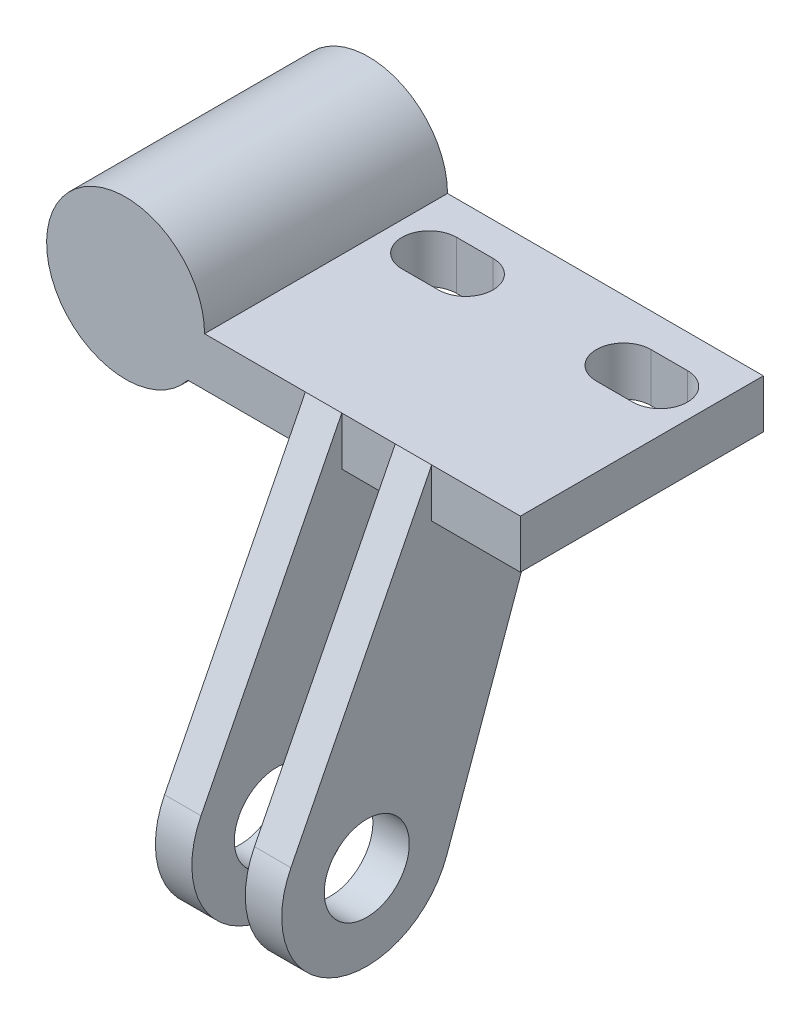
ISO-10303-21;
HEADER;
FILE_DESCRIPTION(('STEP AP214'),'2;1');
FILE_NAME('part.step','',(''),(''),'','','');
FILE_SCHEMA(('AUTOMOTIVE_DESIGN { 1 0 10303 214 1 1 1 1 }'));
ENDSEC;
DATA;
#1=APPLICATION_CONTEXT('core data for automotive mechanical design processes');
#2=APPLICATION_PROTOCOL_DEFINITION('international standard','automotive_design',2000,#1);
#3=PRODUCT_CONTEXT('',#1,'mechanical');
#4=PRODUCT('Part','Part','',(#3));
#5=PRODUCT_RELATED_PRODUCT_CATEGORY('part','',(#4));
#6=PRODUCT_DEFINITION_FORMATION('','',#4);
#7=PRODUCT_DEFINITION_CONTEXT('part definition',#1,'design');
#8=PRODUCT_DEFINITION('design','',#6,#7);
#9=PRODUCT_DEFINITION_SHAPE('','',#8);
#10=(LENGTH_UNIT() NAMED_UNIT(*) SI_UNIT(.MILLI.,.METRE.));
#11=(NAMED_UNIT(*) PLANE_ANGLE_UNIT() SI_UNIT($,.RADIAN.));
#12=(NAMED_UNIT(*) SI_UNIT($,.STERADIAN.) SOLID_ANGLE_UNIT());
#13=UNCERTAINTY_MEASURE_WITH_UNIT(LENGTH_MEASURE(1.E-05),#10,'distance_accuracy_value','');
#14=(GEOMETRIC_REPRESENTATION_CONTEXT(3) GLOBAL_UNCERTAINTY_ASSIGNED_CONTEXT((#13)) GLOBAL_UNIT_ASSIGNED_CONTEXT((#10,
#11,#12)) REPRESENTATION_CONTEXT('',''));
#15=CARTESIAN_POINT('',(0.,0.,0.));
#16=DIRECTION('',(0.,0.,1.));
#17=DIRECTION('',(1.,0.,0.));
#18=AXIS2_PLACEMENT_3D('',#15,#16,#17);
#19=CARTESIAN_POINT('',(5.1234753829798,-4.,20.));
#20=DIRECTION('',(0.,1.,0.));
#21=DIRECTION('',(0.,0.,1.));
#22=AXIS2_PLACEMENT_3D('',#19,#20,#21);
#23=PLANE('',#22);
#24=DIRECTION('',(-1.,0.,0.));
#25=VECTOR('',#24,1.);
#26=CARTESIAN_POINT('',(5.1234753829798,-4.,2.75));
#27=LINE('',#26,#25);
#28=CARTESIAN_POINT('',(13.,-4.,2.75));
#29=VERTEX_POINT('',#28);
#30=CARTESIAN_POINT('',(10.,-4.,2.75));
#31=VERTEX_POINT('',#30);
#32=EDGE_CURVE('E338',#29,#31,#27,.T.);
#33=ORIENTED_EDGE('',*,*,#32,.T.);
#34=CARTESIAN_POINT('',(10.,-4.,5.));
#35=DIRECTION('',(0.,1.,0.));
#36=DIRECTION('',(0.,0.,1.));
#37=AXIS2_PLACEMENT_3D('',#34,#35,#36);
#38=CIRCLE('',#37,2.25);
#39=CARTESIAN_POINT('',(10.,-4.,7.25));
#40=VERTEX_POINT('',#39);
#41=EDGE_CURVE('E341',#31,#40,#38,.T.);
#42=ORIENTED_EDGE('',*,*,#41,.T.);
#43=DIRECTION('',(1.,0.,0.));
#44=VECTOR('',#43,1.);
#45=CARTESIAN_POINT('',(5.1234753829798,-4.,7.25));
#46=LINE('',#45,#44);
#47=CARTESIAN_POINT('',(13.,-4.,7.25));
#48=VERTEX_POINT('',#47);
#49=EDGE_CURVE('E332',#40,#48,#46,.T.);
#50=ORIENTED_EDGE('',*,*,#49,.T.);
#51=CARTESIAN_POINT('',(13.,-4.,5.));
#52=DIRECTION('',(0.,1.,0.));
#53=DIRECTION('',(0.,0.,1.));
#54=AXIS2_PLACEMENT_3D('',#51,#52,#53);
#55=CIRCLE('',#54,2.25);
#56=EDGE_CURVE('E335',#48,#29,#55,.T.);
#57=ORIENTED_EDGE('',*,*,#56,.T.);
#58=EDGE_LOOP('',(#33,#42,#50,#57));
#59=FACE_BOUND('',#58,.T.);
#60=DIRECTION('',(-1.,0.,0.));
#61=VECTOR('',#60,1.);
#62=CARTESIAN_POINT('',(5.1234753829798,-4.,2.75));
#63=LINE('',#62,#61);
#64=CARTESIAN_POINT('',(29.,-4.,2.75));
#65=VERTEX_POINT('',#64);
#66=CARTESIAN_POINT('',(26.,-4.,2.75));
#67=VERTEX_POINT('',#66);
#68=EDGE_CURVE('E326',#65,#67,#63,.T.);
#69=ORIENTED_EDGE('',*,*,#68,.T.);
#70=CARTESIAN_POINT('',(26.,-4.,5.));
#71=DIRECTION('',(0.,1.,0.));
#72=DIRECTION('',(0.,0.,1.));
#73=AXIS2_PLACEMENT_3D('',#70,#71,#72);
#74=CIRCLE('',#73,2.25);
#75=CARTESIAN_POINT('',(26.,-4.,7.25));
#76=VERTEX_POINT('',#75);
#77=EDGE_CURVE('E329',#67,#76,#74,.T.);
#78=ORIENTED_EDGE('',*,*,#77,.T.);
#79=DIRECTION('',(1.,0.,0.));
#80=VECTOR('',#79,1.);
#81=CARTESIAN_POINT('',(5.1234753829798,-4.,7.25));
#82=LINE('',#81,#80);
#83=CARTESIAN_POINT('',(29.,-4.,7.25));
#84=VERTEX_POINT('',#83);
#85=EDGE_CURVE('E296',#76,#84,#82,.T.);
#86=ORIENTED_EDGE('',*,*,#85,.T.);
#87=CARTESIAN_POINT('',(29.,-4.,5.));
#88=DIRECTION('',(0.,1.,0.));
#89=DIRECTION('',(0.,0.,1.));
#90=AXIS2_PLACEMENT_3D('',#87,#88,#89);
#91=CIRCLE('',#90,2.25);
#92=EDGE_CURVE('E323',#84,#65,#91,.T.);
#93=ORIENTED_EDGE('',*,*,#92,.T.);
#94=EDGE_LOOP('',(#69,#78,#86,#93));
#95=FACE_BOUND('',#94,.T.);
#96=DIRECTION('',(0.,0.,-1.));
#97=VECTOR('',#96,1.);
#98=CARTESIAN_POINT('',(14.8,-4.,20.));
#99=LINE('',#98,#97);
#100=CARTESIAN_POINT('',(14.8,-4.,20.));
#101=VERTEX_POINT('',#100);
#102=CARTESIAN_POINT('',(14.8,-4.,10.0000000000152));
#103=VERTEX_POINT('',#102);
#104=EDGE_CURVE('E211',#101,#103,#99,.T.);
#105=ORIENTED_EDGE('',*,*,#104,.F.);
#106=DIRECTION('',(1.,0.,0.));
#107=VECTOR('',#106,1.);
#108=CARTESIAN_POINT('',(5.1234753829798,-4.,20.));
#109=LINE('',#108,#107);
#110=CARTESIAN_POINT('',(5.1234753829798,-4.,20.));
#111=VERTEX_POINT('',#110);
#112=EDGE_CURVE('E353',#111,#101,#109,.T.);
#113=ORIENTED_EDGE('',*,*,#112,.F.);
#114=DIRECTION('',(0.,0.,-1.));
#115=VECTOR('',#114,1.);
#116=CARTESIAN_POINT('',(5.1234753829798,-4.,20.));
#117=LINE('',#116,#115);
#118=CARTESIAN_POINT('',(5.1234753829798,-4.,0.));
#119=VERTEX_POINT('',#118);
#120=EDGE_CURVE('E11',#111,#119,#117,.T.);
#121=ORIENTED_EDGE('',*,*,#120,.T.);
#122=DIRECTION('',(1.,0.,0.));
#123=VECTOR('',#122,1.);
#124=CARTESIAN_POINT('',(5.1234753829798,-4.,0.));
#125=LINE('',#124,#123);
#126=CARTESIAN_POINT('',(32.5,-4.,0.));
#127=VERTEX_POINT('',#126);
#128=EDGE_CURVE('E367',#119,#127,#125,.T.);
#129=ORIENTED_EDGE('',*,*,#128,.T.);
#130=DIRECTION('',(0.,0.,-1.));
#131=VECTOR('',#130,1.);
#132=CARTESIAN_POINT('',(32.5,-4.,20.));
#133=LINE('',#132,#131);
#134=CARTESIAN_POINT('',(32.5,-4.,20.));
#135=VERTEX_POINT('',#134);
#136=EDGE_CURVE('E52',#135,#127,#133,.T.);
#137=ORIENTED_EDGE('',*,*,#136,.F.);
#138=CARTESIAN_POINT('',(25.2,-4.,20.));
#139=VERTEX_POINT('',#138);
#140=EDGE_CURVE('E351',#139,#135,#109,.T.);
#141=ORIENTED_EDGE('',*,*,#140,.F.);
#142=DIRECTION('',(0.,0.,1.));
#143=VECTOR('',#142,1.);
#144=CARTESIAN_POINT('',(25.2,-4.,20.));
#145=LINE('',#144,#143);
#146=CARTESIAN_POINT('',(25.2,-4.,10.0000000000152));
#147=VERTEX_POINT('',#146);
#148=EDGE_CURVE('E275',#147,#139,#145,.T.);
#149=ORIENTED_EDGE('',*,*,#148,.F.);
#150=DIRECTION('',(-1.,0.,0.));
#151=VECTOR('',#150,1.);
#152=CARTESIAN_POINT('',(25.2,-3.99999999995766,10.));
#153=LINE('',#152,#151);
#154=CARTESIAN_POINT('',(22.2,-4.,10.0000000000152));
#155=VERTEX_POINT('',#154);
#156=EDGE_CURVE('E253',#147,#155,#153,.T.);
#157=ORIENTED_EDGE('',*,*,#156,.T.);
#158=DIRECTION('',(0.,0.,1.));
#159=VECTOR('',#158,1.);
#160=CARTESIAN_POINT('',(22.2,-4.,20.));
#161=LINE('',#160,#159);
#162=CARTESIAN_POINT('',(22.2,-4.,20.));
#163=VERTEX_POINT('',#162);
#164=EDGE_CURVE('E269',#155,#163,#161,.T.);
#165=ORIENTED_EDGE('',*,*,#164,.T.);
#166=CARTESIAN_POINT('',(17.8,-4.,20.));
#167=VERTEX_POINT('',#166);
#168=EDGE_CURVE('E357',#167,#163,#109,.T.);
#169=ORIENTED_EDGE('',*,*,#168,.F.);
#170=DIRECTION('',(0.,0.,-1.));
#171=VECTOR('',#170,1.);
#172=CARTESIAN_POINT('',(17.8,-4.,20.));
#173=LINE('',#172,#171);
#174=CARTESIAN_POINT('',(17.8,-4.,10.));
#175=VERTEX_POINT('',#174);
#176=EDGE_CURVE('E64',#167,#175,#173,.T.);
#177=ORIENTED_EDGE('',*,*,#176,.T.);
#178=DIRECTION('',(1.,0.,0.));
#179=VECTOR('',#178,1.);
#180=CARTESIAN_POINT('',(14.8,-3.99999999995766,10.));
#181=LINE('',#180,#179);
#182=EDGE_CURVE('E59',#103,#175,#181,.T.);
#183=ORIENTED_EDGE('',*,*,#182,.F.);
#184=EDGE_LOOP('',(#105,#113,#121,#129,#137,#141,#149,#157,#165,#169,#177,#183));
#185=FACE_BOUND('',#184,.T.);
#186=ADVANCED_FACE('F43',(#59,#95,#185),#23,.F.);
#187=CARTESIAN_POINT('',(0.,0.,20.));
#188=DIRECTION('',(0.,0.,1.));
#189=DIRECTION('',(1.,0.,0.));
#190=AXIS2_PLACEMENT_3D('',#187,#188,#189);
#191=PLANE('',#190);
#192=ORIENTED_EDGE('',*,*,#112,.T.);
#193=DIRECTION('',(0.,1.,0.));
#194=VECTOR('',#193,1.);
#195=CARTESIAN_POINT('',(14.8,0.,20.));
#196=LINE('',#195,#194);
#197=CARTESIAN_POINT('',(14.8,0.,20.));
#198=VERTEX_POINT('',#197);
#199=EDGE_CURVE('E234',#101,#198,#196,.T.);
#200=ORIENTED_EDGE('',*,*,#199,.T.);
#201=DIRECTION('',(-1.,0.,0.));
#202=VECTOR('',#201,1.);
#203=CARTESIAN_POINT('',(32.5,0.,20.));
#204=LINE('',#203,#202);
#205=CARTESIAN_POINT('',(6.5,0.,20.));
#206=VERTEX_POINT('',#205);
#207=EDGE_CURVE('E359',#198,#206,#204,.T.);
#208=ORIENTED_EDGE('',*,*,#207,.T.);
#209=CARTESIAN_POINT('',(0.,0.,20.));
#210=DIRECTION('',(0.,0.,1.));
#211=DIRECTION('',(1.,0.,0.));
#212=AXIS2_PLACEMENT_3D('',#209,#210,#211);
#213=CIRCLE('',#212,6.5);
#214=EDGE_CURVE('E348',#206,#111,#213,.T.);
#215=ORIENTED_EDGE('',*,*,#214,.T.);
#216=EDGE_LOOP('',(#192,#200,#208,#215));
#217=FACE_BOUND('',#216,.T.);
#218=ADVANCED_FACE('F398',(#217),#191,.T.);
#219=CARTESIAN_POINT('',(32.5,0.,20.));
#220=VERTEX_POINT('',#219);
#221=CARTESIAN_POINT('',(25.2,0.,20.));
#222=VERTEX_POINT('',#221);
#223=EDGE_CURVE('E360',#220,#222,#204,.T.);
#224=ORIENTED_EDGE('',*,*,#223,.T.);
#225=DIRECTION('',(0.,-1.,0.));
#226=VECTOR('',#225,1.);
#227=CARTESIAN_POINT('',(25.2,0.,20.));
#228=LINE('',#227,#226);
#229=EDGE_CURVE('E278',#222,#139,#228,.T.);
#230=ORIENTED_EDGE('',*,*,#229,.T.);
#231=ORIENTED_EDGE('',*,*,#140,.T.);
#232=DIRECTION('',(0.,1.,0.));
#233=VECTOR('',#232,1.);
#234=CARTESIAN_POINT('',(32.5,-4.,20.));
#235=LINE('',#234,#233);
#236=EDGE_CURVE('E356',#135,#220,#235,.T.);
#237=ORIENTED_EDGE('',*,*,#236,.T.);
#238=EDGE_LOOP('',(#224,#230,#231,#237));
#239=FACE_BOUND('',#238,.T.);
#240=ADVANCED_FACE('F427',(#239),#191,.T.);
#241=CARTESIAN_POINT('',(0.,0.,20.));
#242=DIRECTION('',(0.,0.,-1.));
#243=DIRECTION('',(-1.,0.,0.));
#244=AXIS2_PLACEMENT_3D('',#241,#242,#243);
#245=CYLINDRICAL_SURFACE('',#244,4.1);
#246=CARTESIAN_POINT('',(0.,0.,0.));
#247=DIRECTION('',(0.,0.,1.));
#248=DIRECTION('',(1.,0.,0.));
#249=AXIS2_PLACEMENT_3D('',#246,#247,#248);
#250=CIRCLE('',#249,4.1);
#251=CARTESIAN_POINT('',(4.1,0.,0.));
#252=VERTEX_POINT('',#251);
#253=EDGE_CURVE('E344',#252,#252,#250,.T.);
#254=ORIENTED_EDGE('',*,*,#253,.F.);
#255=EDGE_LOOP('',(#254));
#256=FACE_BOUND('',#255,.T.);
#257=CARTESIAN_POINT('',(0.,0.,17.));
#258=DIRECTION('',(0.,0.,1.));
#259=DIRECTION('',(1.,0.,0.));
#260=AXIS2_PLACEMENT_3D('',#257,#258,#259);
#261=CIRCLE('',#260,4.1);
#262=CARTESIAN_POINT('',(4.1,0.,17.));
#263=VERTEX_POINT('',#262);
#264=EDGE_CURVE('E47',#263,#263,#261,.T.);
#265=ORIENTED_EDGE('',*,*,#264,.T.);
#266=EDGE_LOOP('',(#265));
#267=FACE_BOUND('',#266,.T.);
#268=ADVANCED_FACE('F440',(#256,#267),#245,.F.);
#269=DIRECTION('',(0.,1.,0.));
#270=VECTOR('',#269,1.);
#271=CARTESIAN_POINT('',(17.8,0.,20.));
#272=LINE('',#271,#270);
#273=CARTESIAN_POINT('',(17.8,0.,20.));
#274=VERTEX_POINT('',#273);
#275=EDGE_CURVE('E230',#167,#274,#272,.T.);
#276=ORIENTED_EDGE('',*,*,#275,.F.);
#277=ORIENTED_EDGE('',*,*,#168,.T.);
#278=DIRECTION('',(0.,-1.,0.));
#279=VECTOR('',#278,1.);
#280=CARTESIAN_POINT('',(22.2,0.,20.));
#281=LINE('',#280,#279);
#282=CARTESIAN_POINT('',(22.2,0.,20.));
#283=VERTEX_POINT('',#282);
#284=EDGE_CURVE('E272',#283,#163,#281,.T.);
#285=ORIENTED_EDGE('',*,*,#284,.F.);
#286=EDGE_CURVE('E364',#283,#274,#204,.T.);
#287=ORIENTED_EDGE('',*,*,#286,.T.);
#288=EDGE_LOOP('',(#276,#277,#285,#287));
#289=FACE_BOUND('',#288,.T.);
#290=ADVANCED_FACE('F403',(#289),#191,.T.);
#291=CARTESIAN_POINT('',(0.,0.,0.));
#292=DIRECTION('',(0.,0.,1.));
#293=DIRECTION('',(1.,0.,0.));
#294=AXIS2_PLACEMENT_3D('',#291,#292,#293);
#295=PLANE('',#294);
#296=CARTESIAN_POINT('',(0.,0.,0.));
#297=DIRECTION('',(0.,0.,1.));
#298=DIRECTION('',(1.,0.,0.));
#299=AXIS2_PLACEMENT_3D('',#296,#297,#298);
#300=CIRCLE('',#299,6.5);
#301=CARTESIAN_POINT('',(6.5,0.,0.));
#302=VERTEX_POINT('',#301);
#303=EDGE_CURVE('E347',#302,#119,#300,.T.);
#304=ORIENTED_EDGE('',*,*,#303,.F.);
#305=DIRECTION('',(-1.,0.,0.));
#306=VECTOR('',#305,1.);
#307=CARTESIAN_POINT('',(32.5,0.,0.));
#308=LINE('',#307,#306);
#309=CARTESIAN_POINT('',(32.5,0.,0.));
#310=VERTEX_POINT('',#309);
#311=EDGE_CURVE('E352',#310,#302,#308,.T.);
#312=ORIENTED_EDGE('',*,*,#311,.F.);
#313=DIRECTION('',(0.,1.,0.));
#314=VECTOR('',#313,1.);
#315=CARTESIAN_POINT('',(32.5,-4.,0.));
#316=LINE('',#315,#314);
#317=EDGE_CURVE('E369',#127,#310,#316,.T.);
#318=ORIENTED_EDGE('',*,*,#317,.F.);
#319=ORIENTED_EDGE('',*,*,#128,.F.);
#320=EDGE_LOOP('',(#304,#312,#318,#319));
#321=FACE_BOUND('',#320,.T.);
#322=ORIENTED_EDGE('',*,*,#253,.T.);
#323=EDGE_LOOP('',(#322));
#324=FACE_BOUND('',#323,.T.);
#325=ADVANCED_FACE('F388',(#321,#324),#295,.F.);
#326=CARTESIAN_POINT('',(0.,0.,20.));
#327=DIRECTION('',(0.,0.,-1.));
#328=DIRECTION('',(-1.,0.,0.));
#329=AXIS2_PLACEMENT_3D('',#326,#327,#328);
#330=CYLINDRICAL_SURFACE('',#329,6.5);
#331=ORIENTED_EDGE('',*,*,#303,.T.);
#332=ORIENTED_EDGE('',*,*,#120,.F.);
#333=ORIENTED_EDGE('',*,*,#214,.F.);
#334=DIRECTION('',(0.,0.,-1.));
#335=VECTOR('',#334,1.);
#336=CARTESIAN_POINT('',(6.5,0.,20.));
#337=LINE('',#336,#335);
#338=EDGE_CURVE('E363',#206,#302,#337,.T.);
#339=ORIENTED_EDGE('',*,*,#338,.T.);
#340=EDGE_LOOP('',(#331,#332,#333,#339));
#341=FACE_BOUND('',#340,.T.);
#342=ADVANCED_FACE('F45',(#341),#330,.T.);
#343=CARTESIAN_POINT('',(32.5,-4.,20.));
#344=DIRECTION('',(-1.,0.,0.));
#345=DIRECTION('',(0.,0.,1.));
#346=AXIS2_PLACEMENT_3D('',#343,#344,#345);
#347=PLANE('',#346);
#348=ORIENTED_EDGE('',*,*,#317,.T.);
#349=DIRECTION('',(0.,0.,-1.));
#350=VECTOR('',#349,1.);
#351=CARTESIAN_POINT('',(32.5,0.,20.));
#352=LINE('',#351,#350);
#353=EDGE_CURVE('E374',#220,#310,#352,.T.);
#354=ORIENTED_EDGE('',*,*,#353,.F.);
#355=ORIENTED_EDGE('',*,*,#236,.F.);
#356=ORIENTED_EDGE('',*,*,#136,.T.);
#357=EDGE_LOOP('',(#348,#354,#355,#356));
#358=FACE_BOUND('',#357,.T.);
#359=ADVANCED_FACE('F382',(#358),#347,.F.);
#360=CARTESIAN_POINT('',(32.5,0.,20.));
#361=DIRECTION('',(0.,-1.,0.));
#362=DIRECTION('',(1.,0.,0.));
#363=AXIS2_PLACEMENT_3D('',#360,#361,#362);
#364=PLANE('',#363);
#365=DIRECTION('',(1.,0.,0.));
#366=VECTOR('',#365,1.);
#367=CARTESIAN_POINT('',(10.,0.,7.25));
#368=LINE('',#367,#366);
#369=CARTESIAN_POINT('',(10.,0.,7.25));
#370=VERTEX_POINT('',#369);
#371=CARTESIAN_POINT('',(13.,0.,7.25));
#372=VERTEX_POINT('',#371);
#373=EDGE_CURVE('E283',#370,#372,#368,.T.);
#374=ORIENTED_EDGE('',*,*,#373,.F.);
#375=CARTESIAN_POINT('',(10.,0.,5.));
#376=DIRECTION('',(0.,1.,0.));
#377=DIRECTION('',(-1.,0.,0.));
#378=AXIS2_PLACEMENT_3D('',#375,#376,#377);
#379=CIRCLE('',#378,2.25);
#380=CARTESIAN_POINT('',(10.,0.,2.75));
#381=VERTEX_POINT('',#380);
#382=EDGE_CURVE('E281',#381,#370,#379,.T.);
#383=ORIENTED_EDGE('',*,*,#382,.F.);
#384=DIRECTION('',(-1.,0.,0.));
#385=VECTOR('',#384,1.);
#386=CARTESIAN_POINT('',(10.,0.,2.75));
#387=LINE('',#386,#385);
#388=CARTESIAN_POINT('',(13.,0.,2.75));
#389=VERTEX_POINT('',#388);
#390=EDGE_CURVE('E290',#389,#381,#387,.T.);
#391=ORIENTED_EDGE('',*,*,#390,.F.);
#392=CARTESIAN_POINT('',(13.,0.,5.));
#393=DIRECTION('',(0.,1.,0.));
#394=DIRECTION('',(-1.,0.,0.));
#395=AXIS2_PLACEMENT_3D('',#392,#393,#394);
#396=CIRCLE('',#395,2.25);
#397=EDGE_CURVE('E287',#372,#389,#396,.T.);
#398=ORIENTED_EDGE('',*,*,#397,.F.);
#399=EDGE_LOOP('',(#374,#383,#391,#398));
#400=FACE_BOUND('',#399,.T.);
#401=DIRECTION('',(1.,0.,0.));
#402=VECTOR('',#401,1.);
#403=CARTESIAN_POINT('',(26.,0.,7.25));
#404=LINE('',#403,#402);
#405=CARTESIAN_POINT('',(26.,0.,7.25));
#406=VERTEX_POINT('',#405);
#407=CARTESIAN_POINT('',(29.,0.,7.25));
#408=VERTEX_POINT('',#407);
#409=EDGE_CURVE('E317',#406,#408,#404,.T.);
#410=ORIENTED_EDGE('',*,*,#409,.F.);
#411=CARTESIAN_POINT('',(26.,0.,5.));
#412=DIRECTION('',(0.,1.,0.));
#413=DIRECTION('',(-1.,0.,0.));
#414=AXIS2_PLACEMENT_3D('',#411,#412,#413);
#415=CIRCLE('',#414,2.25);
#416=CARTESIAN_POINT('',(26.,0.,2.75));
#417=VERTEX_POINT('',#416);
#418=EDGE_CURVE('E284',#417,#406,#415,.T.);
#419=ORIENTED_EDGE('',*,*,#418,.F.);
#420=DIRECTION('',(-1.,0.,0.));
#421=VECTOR('',#420,1.);
#422=CARTESIAN_POINT('',(26.,0.,2.75));
#423=LINE('',#422,#421);
#424=CARTESIAN_POINT('',(29.,0.,2.75));
#425=VERTEX_POINT('',#424);
#426=EDGE_CURVE('E306',#425,#417,#423,.T.);
#427=ORIENTED_EDGE('',*,*,#426,.F.);
#428=CARTESIAN_POINT('',(29.,0.,5.));
#429=DIRECTION('',(0.,1.,0.));
#430=DIRECTION('',(-1.,0.,0.));
#431=AXIS2_PLACEMENT_3D('',#428,#429,#430);
#432=CIRCLE('',#431,2.25);
#433=EDGE_CURVE('E314',#408,#425,#432,.T.);
#434=ORIENTED_EDGE('',*,*,#433,.F.);
#435=EDGE_LOOP('',(#410,#419,#427,#434));
#436=FACE_BOUND('',#435,.T.);
#437=ORIENTED_EDGE('',*,*,#311,.T.);
#438=ORIENTED_EDGE('',*,*,#338,.F.);
#439=ORIENTED_EDGE('',*,*,#207,.F.);
#440=DIRECTION('',(1.,0.,0.));
#441=VECTOR('',#440,1.);
#442=CARTESIAN_POINT('',(14.8,0.,20.));
#443=LINE('',#442,#441);
#444=EDGE_CURVE('E217',#198,#274,#443,.T.);
#445=ORIENTED_EDGE('',*,*,#444,.T.);
#446=ORIENTED_EDGE('',*,*,#286,.F.);
#447=DIRECTION('',(-1.,0.,0.));
#448=VECTOR('',#447,1.);
#449=CARTESIAN_POINT('',(25.2,0.,20.));
#450=LINE('',#449,#448);
#451=EDGE_CURVE('E266',#222,#283,#450,.T.);
#452=ORIENTED_EDGE('',*,*,#451,.F.);
#453=ORIENTED_EDGE('',*,*,#223,.F.);
#454=ORIENTED_EDGE('',*,*,#353,.T.);
#455=EDGE_LOOP('',(#437,#438,#439,#445,#446,#452,#453,#454));
#456=FACE_BOUND('',#455,.T.);
#457=ADVANCED_FACE('F392',(#400,#436,#456),#364,.F.);
#458=CARTESIAN_POINT('',(0.,0.,17.));
#459=DIRECTION('',(0.,0.,1.));
#460=DIRECTION('',(1.,0.,0.));
#461=AXIS2_PLACEMENT_3D('',#458,#459,#460);
#462=PLANE('',#461);
#463=ORIENTED_EDGE('',*,*,#264,.F.);
#464=EDGE_LOOP('',(#463));
#465=FACE_BOUND('',#464,.T.);
#466=ADVANCED_FACE('F435',(#465),#462,.F.);
#467=CARTESIAN_POINT('',(26.,-13.,5.));
#468=DIRECTION('',(0.,1.,0.));
#469=DIRECTION('',(-1.,0.,0.));
#470=AXIS2_PLACEMENT_3D('',#467,#468,#469);
#471=CYLINDRICAL_SURFACE('',#470,2.25);
#472=DIRECTION('',(0.,1.,0.));
#473=VECTOR('',#472,1.);
#474=CARTESIAN_POINT('',(26.,-13.,2.75));
#475=LINE('',#474,#473);
#476=EDGE_CURVE('E280',#67,#417,#475,.T.);
#477=ORIENTED_EDGE('',*,*,#476,.T.);
#478=ORIENTED_EDGE('',*,*,#418,.T.);
#479=DIRECTION('',(0.,1.,0.));
#480=VECTOR('',#479,1.);
#481=CARTESIAN_POINT('',(26.,-13.,7.25));
#482=LINE('',#481,#480);
#483=EDGE_CURVE('E303',#76,#406,#482,.T.);
#484=ORIENTED_EDGE('',*,*,#483,.F.);
#485=ORIENTED_EDGE('',*,*,#77,.F.);
#486=EDGE_LOOP('',(#477,#478,#484,#485));
#487=FACE_BOUND('',#486,.T.);
#488=ADVANCED_FACE('F446',(#487),#471,.F.);
#489=CARTESIAN_POINT('',(26.,-13.,2.75));
#490=DIRECTION('',(0.,0.,-1.));
#491=DIRECTION('',(-1.,0.,0.));
#492=AXIS2_PLACEMENT_3D('',#489,#490,#491);
#493=PLANE('',#492);
#494=DIRECTION('',(0.,1.,0.));
#495=VECTOR('',#494,1.);
#496=CARTESIAN_POINT('',(29.,-13.,2.75));
#497=LINE('',#496,#495);
#498=EDGE_CURVE('E309',#65,#425,#497,.T.);
#499=ORIENTED_EDGE('',*,*,#498,.T.);
#500=ORIENTED_EDGE('',*,*,#426,.T.);
#501=ORIENTED_EDGE('',*,*,#476,.F.);
#502=ORIENTED_EDGE('',*,*,#68,.F.);
#503=EDGE_LOOP('',(#499,#500,#501,#502));
#504=FACE_BOUND('',#503,.T.);
#505=ADVANCED_FACE('F448',(#504),#493,.F.);
#506=CARTESIAN_POINT('',(29.,-13.,5.));
#507=DIRECTION('',(0.,1.,0.));
#508=DIRECTION('',(-1.,0.,0.));
#509=AXIS2_PLACEMENT_3D('',#506,#507,#508);
#510=CYLINDRICAL_SURFACE('',#509,2.25);
#511=DIRECTION('',(0.,1.,0.));
#512=VECTOR('',#511,1.);
#513=CARTESIAN_POINT('',(29.,-13.,7.25));
#514=LINE('',#513,#512);
#515=EDGE_CURVE('E307',#84,#408,#514,.T.);
#516=ORIENTED_EDGE('',*,*,#515,.T.);
#517=ORIENTED_EDGE('',*,*,#433,.T.);
#518=ORIENTED_EDGE('',*,*,#498,.F.);
#519=ORIENTED_EDGE('',*,*,#92,.F.);
#520=EDGE_LOOP('',(#516,#517,#518,#519));
#521=FACE_BOUND('',#520,.T.);
#522=ADVANCED_FACE('F451',(#521),#510,.F.);
#523=CARTESIAN_POINT('',(26.,-13.,7.25));
#524=DIRECTION('',(0.,0.,1.));
#525=DIRECTION('',(1.,0.,0.));
#526=AXIS2_PLACEMENT_3D('',#523,#524,#525);
#527=PLANE('',#526);
#528=ORIENTED_EDGE('',*,*,#483,.T.);
#529=ORIENTED_EDGE('',*,*,#409,.T.);
#530=ORIENTED_EDGE('',*,*,#515,.F.);
#531=ORIENTED_EDGE('',*,*,#85,.F.);
#532=EDGE_LOOP('',(#528,#529,#530,#531));
#533=FACE_BOUND('',#532,.T.);
#534=ADVANCED_FACE('F455',(#533),#527,.F.);
#535=CARTESIAN_POINT('',(10.,-13.,5.));
#536=DIRECTION('',(0.,1.,0.));
#537=DIRECTION('',(-1.,0.,0.));
#538=AXIS2_PLACEMENT_3D('',#535,#536,#537);
#539=CYLINDRICAL_SURFACE('',#538,2.25);
#540=DIRECTION('',(0.,1.,0.));
#541=VECTOR('',#540,1.);
#542=CARTESIAN_POINT('',(10.,-13.,2.75));
#543=LINE('',#542,#541);
#544=EDGE_CURVE('E294',#31,#381,#543,.T.);
#545=ORIENTED_EDGE('',*,*,#544,.T.);
#546=ORIENTED_EDGE('',*,*,#382,.T.);
#547=DIRECTION('',(0.,1.,0.));
#548=VECTOR('',#547,1.);
#549=CARTESIAN_POINT('',(10.,-13.,7.25));
#550=LINE('',#549,#548);
#551=EDGE_CURVE('E293',#40,#370,#550,.T.);
#552=ORIENTED_EDGE('',*,*,#551,.F.);
#553=ORIENTED_EDGE('',*,*,#41,.F.);
#554=EDGE_LOOP('',(#545,#546,#552,#553));
#555=FACE_BOUND('',#554,.T.);
#556=ADVANCED_FACE('F459',(#555),#539,.F.);
#557=CARTESIAN_POINT('',(10.,-13.,2.75));
#558=DIRECTION('',(0.,0.,-1.));
#559=DIRECTION('',(-1.,0.,0.));
#560=AXIS2_PLACEMENT_3D('',#557,#558,#559);
#561=PLANE('',#560);
#562=DIRECTION('',(0.,1.,0.));
#563=VECTOR('',#562,1.);
#564=CARTESIAN_POINT('',(13.,-13.,2.75));
#565=LINE('',#564,#563);
#566=EDGE_CURVE('E297',#29,#389,#565,.T.);
#567=ORIENTED_EDGE('',*,*,#566,.T.);
#568=ORIENTED_EDGE('',*,*,#390,.T.);
#569=ORIENTED_EDGE('',*,*,#544,.F.);
#570=ORIENTED_EDGE('',*,*,#32,.F.);
#571=EDGE_LOOP('',(#567,#568,#569,#570));
#572=FACE_BOUND('',#571,.T.);
#573=ADVANCED_FACE('F466',(#572),#561,.F.);
#574=CARTESIAN_POINT('',(13.,-13.,5.));
#575=DIRECTION('',(0.,1.,0.));
#576=DIRECTION('',(-1.,0.,0.));
#577=AXIS2_PLACEMENT_3D('',#574,#575,#576);
#578=CYLINDRICAL_SURFACE('',#577,2.25);
#579=DIRECTION('',(0.,1.,0.));
#580=VECTOR('',#579,1.);
#581=CARTESIAN_POINT('',(13.,-13.,7.25));
#582=LINE('',#581,#580);
#583=EDGE_CURVE('E299',#48,#372,#582,.T.);
#584=ORIENTED_EDGE('',*,*,#583,.T.);
#585=ORIENTED_EDGE('',*,*,#397,.T.);
#586=ORIENTED_EDGE('',*,*,#566,.F.);
#587=ORIENTED_EDGE('',*,*,#56,.F.);
#588=EDGE_LOOP('',(#584,#585,#586,#587));
#589=FACE_BOUND('',#588,.T.);
#590=ADVANCED_FACE('F472',(#589),#578,.F.);
#591=CARTESIAN_POINT('',(10.,-13.,7.25));
#592=DIRECTION('',(0.,0.,1.));
#593=DIRECTION('',(1.,0.,0.));
#594=AXIS2_PLACEMENT_3D('',#591,#592,#593);
#595=PLANE('',#594);
#596=ORIENTED_EDGE('',*,*,#551,.T.);
#597=ORIENTED_EDGE('',*,*,#373,.T.);
#598=ORIENTED_EDGE('',*,*,#583,.F.);
#599=ORIENTED_EDGE('',*,*,#49,.F.);
#600=EDGE_LOOP('',(#596,#597,#598,#599));
#601=FACE_BOUND('',#600,.T.);
#602=ADVANCED_FACE('F468',(#601),#595,.F.);
#603=CARTESIAN_POINT('',(25.2,-26.0779866927372,25.3455707796658));
#604=DIRECTION('',(-1.,0.,0.));
#605=DIRECTION('',(0.,0.,1.));
#606=AXIS2_PLACEMENT_3D('',#603,#604,#605);
#607=PLANE('',#606);
#608=ORIENTED_EDGE('',*,*,#229,.F.);
#609=DIRECTION('',(0.,-0.892350435757835,0.451343217300097));
#610=VECTOR('',#609,1.);
#611=CARTESIAN_POINT('',(25.2,-22.9185841716366,31.5920238299707));
#612=LINE('',#611,#610);
#613=CARTESIAN_POINT('',(25.2,-22.9185841716366,31.5920238299707));
#614=VERTEX_POINT('',#613);
#615=EDGE_CURVE('E245',#222,#614,#612,.T.);
#616=ORIENTED_EDGE('',*,*,#615,.T.);
#617=CARTESIAN_POINT('',(25.2,-26.0779866927372,25.3455707796658));
#618=DIRECTION('',(1.,0.,0.));
#619=DIRECTION('',(0.,0.,1.));
#620=AXIS2_PLACEMENT_3D('',#617,#618,#619);
#621=CIRCLE('',#620,7.);
#622=CARTESIAN_POINT('',(25.2,-28.4389274391951,18.7557332405671));
#623=VERTEX_POINT('',#622);
#624=EDGE_CURVE('E247',#614,#623,#621,.T.);
#625=ORIENTED_EDGE('',*,*,#624,.T.);
#626=DIRECTION('',(0.,0.941405362728391,-0.337277249493984));
#627=VECTOR('',#626,1.);
#628=CARTESIAN_POINT('',(25.2,-3.99999999995766,10.));
#629=LINE('',#628,#627);
#630=EDGE_CURVE('E250',#623,#147,#629,.T.);
#631=ORIENTED_EDGE('',*,*,#630,.T.);
#632=ORIENTED_EDGE('',*,*,#148,.T.);
#633=EDGE_LOOP('',(#608,#616,#625,#631,#632));
#634=FACE_BOUND('',#633,.T.);
#635=CARTESIAN_POINT('',(25.2,-26.0779866927372,25.3455707796658));
#636=DIRECTION('',(1.,0.,0.));
#637=DIRECTION('',(0.,0.,1.));
#638=AXIS2_PLACEMENT_3D('',#635,#636,#637);
#639=CIRCLE('',#638,3.4999999999984);
#640=CARTESIAN_POINT('',(25.2,-26.0779866927372,28.8455707796642));
#641=VERTEX_POINT('',#640);
#642=EDGE_CURVE('E239',#641,#641,#639,.T.);
#643=ORIENTED_EDGE('',*,*,#642,.F.);
#644=EDGE_LOOP('',(#643));
#645=FACE_BOUND('',#644,.T.);
#646=ADVANCED_FACE('F471',(#634,#645),#607,.F.);
#647=CARTESIAN_POINT('',(22.2,-26.0779866927372,25.3455707796658));
#648=DIRECTION('',(-1.,0.,0.));
#649=DIRECTION('',(0.,0.,1.));
#650=AXIS2_PLACEMENT_3D('',#647,#648,#649);
#651=PLANE('',#650);
#652=DIRECTION('',(0.,-0.892350435757835,0.451343217300097));
#653=VECTOR('',#652,1.);
#654=CARTESIAN_POINT('',(22.2,-22.9185841716366,31.5920238299707));
#655=LINE('',#654,#653);
#656=CARTESIAN_POINT('',(22.2,-22.9185841716366,31.5920238299707));
#657=VERTEX_POINT('',#656);
#658=EDGE_CURVE('E242',#283,#657,#655,.T.);
#659=ORIENTED_EDGE('',*,*,#658,.F.);
#660=ORIENTED_EDGE('',*,*,#284,.T.);
#661=ORIENTED_EDGE('',*,*,#164,.F.);
#662=DIRECTION('',(0.,0.941405362728391,-0.337277249493984));
#663=VECTOR('',#662,1.);
#664=CARTESIAN_POINT('',(22.2,-3.99999999995766,10.));
#665=LINE('',#664,#663);
#666=CARTESIAN_POINT('',(22.2,-28.4389274391951,18.7557332405671));
#667=VERTEX_POINT('',#666);
#668=EDGE_CURVE('E248',#667,#155,#665,.T.);
#669=ORIENTED_EDGE('',*,*,#668,.F.);
#670=CARTESIAN_POINT('',(22.2,-26.0779866927372,25.3455707796658));
#671=DIRECTION('',(1.,0.,0.));
#672=DIRECTION('',(0.,0.,1.));
#673=AXIS2_PLACEMENT_3D('',#670,#671,#672);
#674=CIRCLE('',#673,7.);
#675=EDGE_CURVE('E255',#657,#667,#674,.T.);
#676=ORIENTED_EDGE('',*,*,#675,.F.);
#677=EDGE_LOOP('',(#659,#660,#661,#669,#676));
#678=FACE_BOUND('',#677,.T.);
#679=CARTESIAN_POINT('',(22.2,-26.0779866927372,25.3455707796658));
#680=DIRECTION('',(1.,0.,0.));
#681=DIRECTION('',(0.,0.,1.));
#682=AXIS2_PLACEMENT_3D('',#679,#680,#681);
#683=CIRCLE('',#682,3.4999999999984);
#684=CARTESIAN_POINT('',(22.2,-26.0779866927372,28.8455707796642));
#685=VERTEX_POINT('',#684);
#686=EDGE_CURVE('E238',#685,#685,#683,.T.);
#687=ORIENTED_EDGE('',*,*,#686,.T.);
#688=EDGE_LOOP('',(#687));
#689=FACE_BOUND('',#688,.T.);
#690=ADVANCED_FACE('F484',(#678,#689),#651,.T.);
#691=CARTESIAN_POINT('',(25.2,-22.9185841716366,31.5920238299707));
#692=DIRECTION('',(0.,-0.451343217300097,-0.892350435757835));
#693=DIRECTION('',(0.,0.892350435757835,-0.451343217300097));
#694=AXIS2_PLACEMENT_3D('',#691,#692,#693);
#695=PLANE('',#694);
#696=ORIENTED_EDGE('',*,*,#658,.T.);
#697=DIRECTION('',(-1.,0.,0.));
#698=VECTOR('',#697,1.);
#699=CARTESIAN_POINT('',(25.2,-22.9185841716366,31.5920238299707));
#700=LINE('',#699,#698);
#701=EDGE_CURVE('E263',#614,#657,#700,.T.);
#702=ORIENTED_EDGE('',*,*,#701,.F.);
#703=ORIENTED_EDGE('',*,*,#615,.F.);
#704=ORIENTED_EDGE('',*,*,#451,.T.);
#705=EDGE_LOOP('',(#696,#702,#703,#704));
#706=FACE_BOUND('',#705,.T.);
#707=ADVANCED_FACE('F480',(#706),#695,.F.);
#708=CARTESIAN_POINT('',(25.2,-26.0779866927372,25.3455707796658));
#709=DIRECTION('',(-1.,0.,0.));
#710=DIRECTION('',(0.,0.,1.));
#711=AXIS2_PLACEMENT_3D('',#708,#709,#710);
#712=CYLINDRICAL_SURFACE('',#711,7.);
#713=ORIENTED_EDGE('',*,*,#675,.T.);
#714=DIRECTION('',(-1.,0.,0.));
#715=VECTOR('',#714,1.);
#716=CARTESIAN_POINT('',(25.2,-28.4389274391951,18.7557332405671));
#717=LINE('',#716,#715);
#718=EDGE_CURVE('E260',#623,#667,#717,.T.);
#719=ORIENTED_EDGE('',*,*,#718,.F.);
#720=ORIENTED_EDGE('',*,*,#624,.F.);
#721=ORIENTED_EDGE('',*,*,#701,.T.);
#722=EDGE_LOOP('',(#713,#719,#720,#721));
#723=FACE_BOUND('',#722,.T.);
#724=ADVANCED_FACE('F483',(#723),#712,.T.);
#725=CARTESIAN_POINT('',(25.2,-3.99999999995766,10.));
#726=DIRECTION('',(0.,0.337277249493984,0.941405362728391));
#727=DIRECTION('',(0.,-0.941405362728391,0.337277249493984));
#728=AXIS2_PLACEMENT_3D('',#725,#726,#727);
#729=PLANE('',#728);
#730=ORIENTED_EDGE('',*,*,#668,.T.);
#731=ORIENTED_EDGE('',*,*,#156,.F.);
#732=ORIENTED_EDGE('',*,*,#630,.F.);
#733=ORIENTED_EDGE('',*,*,#718,.T.);
#734=EDGE_LOOP('',(#730,#731,#732,#733));
#735=FACE_BOUND('',#734,.T.);
#736=ADVANCED_FACE('F488',(#735),#729,.F.);
#737=CARTESIAN_POINT('',(25.2,-26.0779866927372,25.3455707796658));
#738=DIRECTION('',(-1.,0.,0.));
#739=DIRECTION('',(0.,0.,1.));
#740=AXIS2_PLACEMENT_3D('',#737,#738,#739);
#741=CYLINDRICAL_SURFACE('',#740,3.4999999999984);
#742=ORIENTED_EDGE('',*,*,#642,.T.);
#743=EDGE_LOOP('',(#742));
#744=FACE_BOUND('',#743,.T.);
#745=ORIENTED_EDGE('',*,*,#686,.F.);
#746=EDGE_LOOP('',(#745));
#747=FACE_BOUND('',#746,.T.);
#748=ADVANCED_FACE('F492',(#744,#747),#741,.F.);
#749=CARTESIAN_POINT('',(14.8,-26.0779866927372,25.3455707796658));
#750=DIRECTION('',(1.,0.,0.));
#751=DIRECTION('',(0.,0.,1.));
#752=AXIS2_PLACEMENT_3D('',#749,#750,#751);
#753=PLANE('',#752);
#754=CARTESIAN_POINT('',(14.8,-26.0779866927372,25.3455707796658));
#755=DIRECTION('',(1.,0.,0.));
#756=DIRECTION('',(0.,0.,1.));
#757=AXIS2_PLACEMENT_3D('',#754,#755,#756);
#758=CIRCLE('',#757,3.4999999999984);
#759=CARTESIAN_POINT('',(14.8,-26.0779866927372,28.8455707796642));
#760=VERTEX_POINT('',#759);
#761=EDGE_CURVE('E223',#760,#760,#758,.T.);
#762=ORIENTED_EDGE('',*,*,#761,.T.);
#763=EDGE_LOOP('',(#762));
#764=FACE_BOUND('',#763,.T.);
#765=ORIENTED_EDGE('',*,*,#199,.F.);
#766=ORIENTED_EDGE('',*,*,#104,.T.);
#767=DIRECTION('',(0.,0.941405362728391,-0.337277249493984));
#768=VECTOR('',#767,1.);
#769=CARTESIAN_POINT('',(14.8,-3.99999999995766,10.));
#770=LINE('',#769,#768);
#771=CARTESIAN_POINT('',(14.8,-28.4389274391951,18.7557332405671));
#772=VERTEX_POINT('',#771);
#773=EDGE_CURVE('E195',#772,#103,#770,.T.);
#774=ORIENTED_EDGE('',*,*,#773,.F.);
#775=CARTESIAN_POINT('',(14.8,-26.0779866927372,25.3455707796658));
#776=DIRECTION('',(1.,0.,0.));
#777=DIRECTION('',(0.,0.,1.));
#778=AXIS2_PLACEMENT_3D('',#775,#776,#777);
#779=CIRCLE('',#778,7.);
#780=CARTESIAN_POINT('',(14.8,-22.9185841716366,31.5920238299707));
#781=VERTEX_POINT('',#780);
#782=EDGE_CURVE('E209',#781,#772,#779,.T.);
#783=ORIENTED_EDGE('',*,*,#782,.F.);
#784=DIRECTION('',(0.,-0.892350435757835,0.451343217300097));
#785=VECTOR('',#784,1.);
#786=CARTESIAN_POINT('',(14.8,-22.9185841716366,31.5920238299707));
#787=LINE('',#786,#785);
#788=EDGE_CURVE('E215',#198,#781,#787,.T.);
#789=ORIENTED_EDGE('',*,*,#788,.F.);
#790=EDGE_LOOP('',(#765,#766,#774,#783,#789));
#791=FACE_BOUND('',#790,.T.);
#792=ADVANCED_FACE('F207',(#764,#791),#753,.F.);
#793=CARTESIAN_POINT('',(17.8,-26.0779866927372,25.3455707796658));
#794=DIRECTION('',(1.,0.,0.));
#795=DIRECTION('',(0.,0.,1.));
#796=AXIS2_PLACEMENT_3D('',#793,#794,#795);
#797=PLANE('',#796);
#798=CARTESIAN_POINT('',(17.8,-26.0779866927372,25.3455707796658));
#799=DIRECTION('',(1.,0.,0.));
#800=DIRECTION('',(0.,0.,1.));
#801=AXIS2_PLACEMENT_3D('',#798,#799,#800);
#802=CIRCLE('',#801,3.4999999999984);
#803=CARTESIAN_POINT('',(17.8,-26.0779866927372,28.8455707796642));
#804=VERTEX_POINT('',#803);
#805=EDGE_CURVE('E514',#804,#804,#802,.T.);
#806=ORIENTED_EDGE('',*,*,#805,.F.);
#807=EDGE_LOOP('',(#806));
#808=FACE_BOUND('',#807,.T.);
#809=ORIENTED_EDGE('',*,*,#176,.F.);
#810=ORIENTED_EDGE('',*,*,#275,.T.);
#811=DIRECTION('',(0.,-0.892350435757835,0.451343217300097));
#812=VECTOR('',#811,1.);
#813=CARTESIAN_POINT('',(17.8,-22.9185841716366,31.5920238299707));
#814=LINE('',#813,#812);
#815=CARTESIAN_POINT('',(17.8,-22.9185841716366,31.5920238299707));
#816=VERTEX_POINT('',#815);
#817=EDGE_CURVE('E212',#274,#816,#814,.T.);
#818=ORIENTED_EDGE('',*,*,#817,.T.);
#819=CARTESIAN_POINT('',(17.8,-26.0779866927372,25.3455707796658));
#820=DIRECTION('',(1.,0.,0.));
#821=DIRECTION('',(0.,0.,1.));
#822=AXIS2_PLACEMENT_3D('',#819,#820,#821);
#823=CIRCLE('',#822,7.);
#824=CARTESIAN_POINT('',(17.8,-28.4389274391951,18.7557332405671));
#825=VERTEX_POINT('',#824);
#826=EDGE_CURVE('E222',#816,#825,#823,.T.);
#827=ORIENTED_EDGE('',*,*,#826,.T.);
#828=DIRECTION('',(0.,0.941405362728391,-0.337277249493984));
#829=VECTOR('',#828,1.);
#830=CARTESIAN_POINT('',(17.8,-3.99999999995766,10.));
#831=LINE('',#830,#829);
#832=EDGE_CURVE('E197',#825,#175,#831,.T.);
#833=ORIENTED_EDGE('',*,*,#832,.T.);
#834=EDGE_LOOP('',(#809,#810,#818,#827,#833));
#835=FACE_BOUND('',#834,.T.);
#836=ADVANCED_FACE('F407',(#808,#835),#797,.T.);
#837=CARTESIAN_POINT('',(14.8,-3.99999999995766,10.));
#838=DIRECTION('',(0.,-0.337277249493984,-0.941405362728391));
#839=DIRECTION('',(0.,0.941405362728391,-0.337277249493984));
#840=AXIS2_PLACEMENT_3D('',#837,#838,#839);
#841=PLANE('',#840);
#842=ORIENTED_EDGE('',*,*,#832,.F.);
#843=DIRECTION('',(1.,0.,0.));
#844=VECTOR('',#843,1.);
#845=CARTESIAN_POINT('',(14.8,-28.4389274391951,18.7557332405671));
#846=LINE('',#845,#844);
#847=EDGE_CURVE('E192',#772,#825,#846,.T.);
#848=ORIENTED_EDGE('',*,*,#847,.F.);
#849=ORIENTED_EDGE('',*,*,#773,.T.);
#850=ORIENTED_EDGE('',*,*,#182,.T.);
#851=EDGE_LOOP('',(#842,#848,#849,#850));
#852=FACE_BOUND('',#851,.T.);
#853=ADVANCED_FACE('F194',(#852),#841,.T.);
#854=CARTESIAN_POINT('',(14.8,-26.0779866927372,25.3455707796658));
#855=DIRECTION('',(1.,0.,0.));
#856=DIRECTION('',(0.,0.,-1.));
#857=AXIS2_PLACEMENT_3D('',#854,#855,#856);
#858=CYLINDRICAL_SURFACE('',#857,7.);
#859=ORIENTED_EDGE('',*,*,#826,.F.);
#860=DIRECTION('',(1.,0.,0.));
#861=VECTOR('',#860,1.);
#862=CARTESIAN_POINT('',(14.8,-22.9185841716366,31.5920238299707));
#863=LINE('',#862,#861);
#864=EDGE_CURVE('E202',#781,#816,#863,.T.);
#865=ORIENTED_EDGE('',*,*,#864,.F.);
#866=ORIENTED_EDGE('',*,*,#782,.T.);
#867=ORIENTED_EDGE('',*,*,#847,.T.);
#868=EDGE_LOOP('',(#859,#865,#866,#867));
#869=FACE_BOUND('',#868,.T.);
#870=ADVANCED_FACE('F214',(#869),#858,.T.);
#871=CARTESIAN_POINT('',(14.8,-22.9185841716366,31.5920238299707));
#872=DIRECTION('',(0.,0.451343217300097,0.892350435757835));
#873=DIRECTION('',(0.,-0.892350435757835,0.451343217300097));
#874=AXIS2_PLACEMENT_3D('',#871,#872,#873);
#875=PLANE('',#874);
#876=ORIENTED_EDGE('',*,*,#817,.F.);
#877=ORIENTED_EDGE('',*,*,#444,.F.);
#878=ORIENTED_EDGE('',*,*,#788,.T.);
#879=ORIENTED_EDGE('',*,*,#864,.T.);
#880=EDGE_LOOP('',(#876,#877,#878,#879));
#881=FACE_BOUND('',#880,.T.);
#882=ADVANCED_FACE('F409',(#881),#875,.T.);
#883=CARTESIAN_POINT('',(14.8,-26.0779866927372,25.3455707796658));
#884=DIRECTION('',(1.,0.,0.));
#885=DIRECTION('',(0.,0.,-1.));
#886=AXIS2_PLACEMENT_3D('',#883,#884,#885);
#887=CYLINDRICAL_SURFACE('',#886,3.4999999999984);
#888=ORIENTED_EDGE('',*,*,#761,.F.);
#889=EDGE_LOOP('',(#888));
#890=FACE_BOUND('',#889,.T.);
#891=ORIENTED_EDGE('',*,*,#805,.T.);
#892=EDGE_LOOP('',(#891));
#893=FACE_BOUND('',#892,.T.);
#894=ADVANCED_FACE('F411',(#890,#893),#887,.F.);
#895=CLOSED_SHELL('',(#186,#218,#240,#268,#290,#325,#342,#359,#457,#466,#488,#505,#522,#534,
#556,#573,#590,#602,#646,#690,#707,#724,#736,#748,#792,#836,#853,#870,#882,#894));
#896=MANIFOLD_SOLID_BREP('B2',#895);
#897=ADVANCED_BREP_SHAPE_REPRESENTATION('',(#18,#896),#14);
#898=SHAPE_DEFINITION_REPRESENTATION(#9,#897);
ENDSEC;
END-ISO-10303-21;
